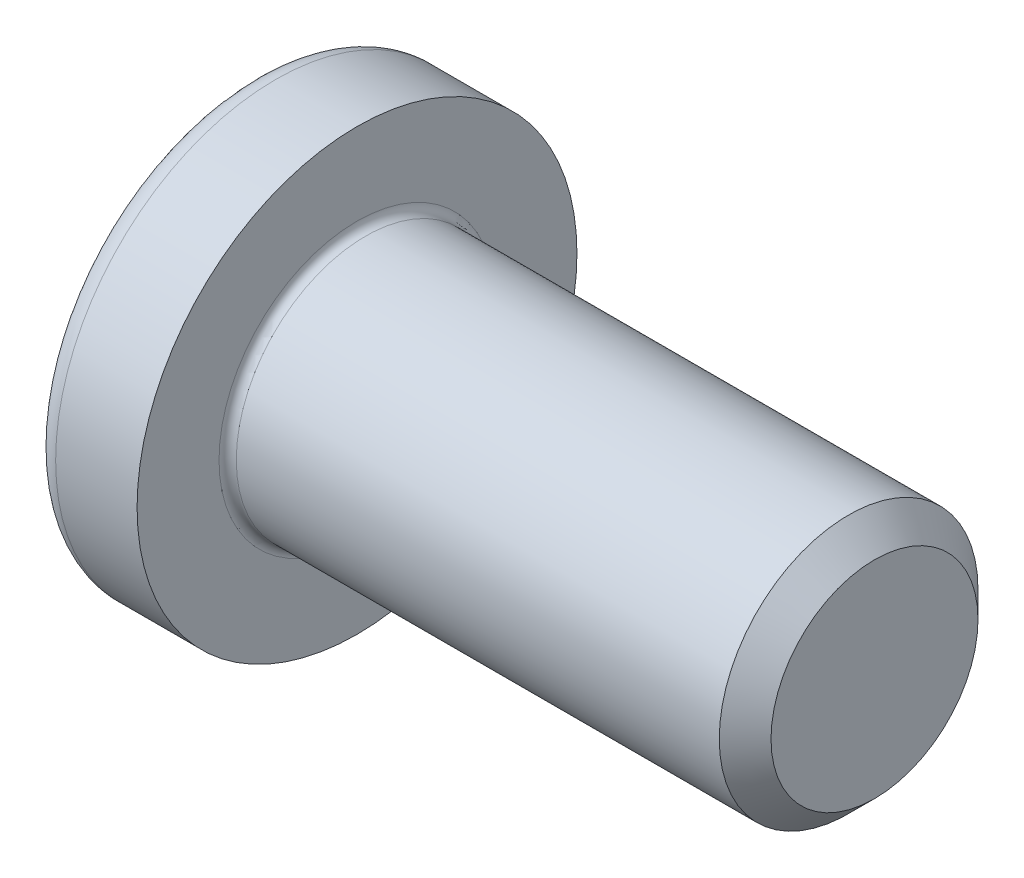
ISO-10303-21;
HEADER;
FILE_DESCRIPTION(('STEP AP214'),'2;1');
FILE_NAME('part.step','',(''),(''),'','','');
FILE_SCHEMA(('AUTOMOTIVE_DESIGN { 1 0 10303 214 1 1 1 1 }'));
ENDSEC;
DATA;
#1=APPLICATION_CONTEXT('core data for automotive mechanical design processes');
#2=APPLICATION_PROTOCOL_DEFINITION('international standard','automotive_design',2000,#1);
#3=PRODUCT_CONTEXT('',#1,'mechanical');
#4=PRODUCT('Part','Part','',(#3));
#5=PRODUCT_RELATED_PRODUCT_CATEGORY('part','',(#4));
#6=PRODUCT_DEFINITION_FORMATION('','',#4);
#7=PRODUCT_DEFINITION_CONTEXT('part definition',#1,'design');
#8=PRODUCT_DEFINITION('design','',#6,#7);
#9=PRODUCT_DEFINITION_SHAPE('','',#8);
#10=(LENGTH_UNIT() NAMED_UNIT(*) SI_UNIT(.MILLI.,.METRE.));
#11=(NAMED_UNIT(*) PLANE_ANGLE_UNIT() SI_UNIT($,.RADIAN.));
#12=(NAMED_UNIT(*) SI_UNIT($,.STERADIAN.) SOLID_ANGLE_UNIT());
#13=UNCERTAINTY_MEASURE_WITH_UNIT(LENGTH_MEASURE(1.E-05),#10,'distance_accuracy_value','');
#14=(GEOMETRIC_REPRESENTATION_CONTEXT(3) GLOBAL_UNCERTAINTY_ASSIGNED_CONTEXT((#13)) GLOBAL_UNIT_ASSIGNED_CONTEXT((#10,
#11,#12)) REPRESENTATION_CONTEXT('',''));
#15=CARTESIAN_POINT('',(0.,0.,0.));
#16=DIRECTION('',(0.,0.,1.));
#17=DIRECTION('',(1.,0.,0.));
#18=AXIS2_PLACEMENT_3D('',#15,#16,#17);
#19=CARTESIAN_POINT('',(5.,0.,0.));
#20=DIRECTION('',(-1.,0.,0.));
#21=DIRECTION('',(0.,1.,0.));
#22=AXIS2_PLACEMENT_3D('',#19,#20,#21);
#23=SPHERICAL_SURFACE('',#22,5.);
#24=CARTESIAN_POINT('',(0.619225335758571,0.,0.));
#25=DIRECTION('',(-1.,0.,0.));
#26=DIRECTION('',(0.,0.,1.));
#27=AXIS2_PLACEMENT_3D('',#24,#25,#26);
#28=CIRCLE('',#27,2.41014799154334);
#29=CARTESIAN_POINT('',(0.619225335758571,0.,2.41014799154334));
#30=VERTEX_POINT('',#29);
#31=EDGE_CURVE('E350',#30,#30,#28,.T.);
#32=ORIENTED_EDGE('',*,*,#31,.T.);
#33=EDGE_LOOP('',(#32));
#34=FACE_BOUND('',#33,.T.);
#35=CARTESIAN_POINT('',(0.04579512008964,0.,0.));
#36=DIRECTION('',(1.,0.,0.));
#37=DIRECTION('',(0.,0.,-1.));
#38=AXIS2_PLACEMENT_3D('',#35,#36,#37);
#39=CIRCLE('',#38,0.675169614150692);
#40=CARTESIAN_POINT('',(0.0457951200896384,-0.449999999999998,-0.503342833337673));
#41=VERTEX_POINT('',#40);
#42=CARTESIAN_POINT('',(0.0457951201179364,-0.503342833335017,-0.45));
#43=VERTEX_POINT('',#42);
#44=EDGE_CURVE('E398',#41,#43,#39,.F.);
#45=ORIENTED_EDGE('',*,*,#44,.F.);
#46=CARTESIAN_POINT('',(5.,-0.45,0.));
#47=DIRECTION('',(0.,1.,0.));
#48=DIRECTION('',(0.,0.,1.));
#49=AXIS2_PLACEMENT_3D('',#46,#47,#48);
#50=CIRCLE('',#49,4.97970882682914);
#51=CARTESIAN_POINT('',(0.286729744391537,-0.449999999999994,-1.60704184687163));
#52=VERTEX_POINT('',#51);
#53=EDGE_CURVE('E416',#52,#41,#50,.T.);
#54=ORIENTED_EDGE('',*,*,#53,.F.);
#55=CARTESIAN_POINT('',(4.70334382550035,0.,0.595000335588224));
#56=DIRECTION('',(0.446197753347436,0.,-0.894934391398443));
#57=DIRECTION('',(-0.894934391398442,0.,-0.446197753347436));
#58=AXIS2_PLACEMENT_3D('',#55,#56,#57);
#59=CIRCLE('',#58,4.95559983400407);
#60=CARTESIAN_POINT('',(0.286729744391538,0.450000000000006,-1.60704184687162));
#61=VERTEX_POINT('',#60);
#62=EDGE_CURVE('E237',#52,#61,#59,.T.);
#63=ORIENTED_EDGE('',*,*,#62,.T.);
#64=CARTESIAN_POINT('',(5.,0.45,0.));
#65=DIRECTION('',(0.,-1.,0.));
#66=DIRECTION('',(0.,0.,-1.));
#67=AXIS2_PLACEMENT_3D('',#64,#65,#66);
#68=CIRCLE('',#67,4.97970882682914);
#69=CARTESIAN_POINT('',(0.0457951200896617,0.450000000000002,-0.503342833337888));
#70=VERTEX_POINT('',#69);
#71=EDGE_CURVE('E339',#70,#61,#68,.T.);
#72=ORIENTED_EDGE('',*,*,#71,.F.);
#73=CARTESIAN_POINT('',(0.0457951200896401,0.503342833337671,-0.45));
#74=VERTEX_POINT('',#73);
#75=EDGE_CURVE('E396',#74,#70,#39,.F.);
#76=ORIENTED_EDGE('',*,*,#75,.F.);
#77=CARTESIAN_POINT('',(5.,0.,-0.45));
#78=DIRECTION('',(0.,0.,1.));
#79=DIRECTION('',(0.,-1.,0.));
#80=AXIS2_PLACEMENT_3D('',#77,#78,#79);
#81=CIRCLE('',#80,4.97970882682914);
#82=CARTESIAN_POINT('',(0.28672974439154,1.60704184687162,-0.45));
#83=VERTEX_POINT('',#82);
#84=EDGE_CURVE('E231',#83,#74,#81,.T.);
#85=ORIENTED_EDGE('',*,*,#84,.F.);
#86=CARTESIAN_POINT('',(4.70334382550035,-0.595000335588225,0.));
#87=DIRECTION('',(0.446197753347436,0.894934391398443,0.));
#88=DIRECTION('',(-0.894934391398442,0.446197753347436,0.));
#89=AXIS2_PLACEMENT_3D('',#86,#87,#88);
#90=CIRCLE('',#89,4.95559983400407);
#91=CARTESIAN_POINT('',(0.286729744391541,1.60704184687162,0.45));
#92=VERTEX_POINT('',#91);
#93=EDGE_CURVE('E234',#83,#92,#90,.T.);
#94=ORIENTED_EDGE('',*,*,#93,.T.);
#95=CARTESIAN_POINT('',(5.,0.,0.45));
#96=DIRECTION('',(0.,0.,-1.));
#97=DIRECTION('',(0.,1.,0.));
#98=AXIS2_PLACEMENT_3D('',#95,#96,#97);
#99=CIRCLE('',#98,4.97970882682914);
#100=CARTESIAN_POINT('',(0.045795120117937,0.503342833335017,0.45));
#101=VERTEX_POINT('',#100);
#102=EDGE_CURVE('E226',#101,#92,#99,.T.);
#103=ORIENTED_EDGE('',*,*,#102,.F.);
#104=CARTESIAN_POINT('',(0.0457951200896394,0.449999999999998,0.503342833337673));
#105=VERTEX_POINT('',#104);
#106=EDGE_CURVE('E399',#105,#101,#39,.F.);
#107=ORIENTED_EDGE('',*,*,#106,.F.);
#108=CARTESIAN_POINT('',(0.286729744391538,0.449999999999994,1.60704184687163));
#109=VERTEX_POINT('',#108);
#110=EDGE_CURVE('E340',#109,#105,#68,.T.);
#111=ORIENTED_EDGE('',*,*,#110,.F.);
#112=CARTESIAN_POINT('',(4.70334382550035,0.,-0.595000335588224));
#113=DIRECTION('',(0.446197753347436,0.,0.894934391398443));
#114=DIRECTION('',(0.894934391398442,0.,-0.446197753347436));
#115=AXIS2_PLACEMENT_3D('',#112,#113,#114);
#116=CIRCLE('',#115,4.95559983400407);
#117=CARTESIAN_POINT('',(0.286729744391537,-0.450000000000006,1.60704184687162));
#118=VERTEX_POINT('',#117);
#119=EDGE_CURVE('E240',#109,#118,#116,.T.);
#120=ORIENTED_EDGE('',*,*,#119,.T.);
#121=CARTESIAN_POINT('',(0.0457951200896617,-0.450000000000002,0.503342833337888));
#122=VERTEX_POINT('',#121);
#123=EDGE_CURVE('E408',#122,#118,#50,.T.);
#124=ORIENTED_EDGE('',*,*,#123,.F.);
#125=CARTESIAN_POINT('',(0.0457951201179362,-0.503342833335017,0.45));
#126=VERTEX_POINT('',#125);
#127=EDGE_CURVE('E59',#126,#122,#39,.F.);
#128=ORIENTED_EDGE('',*,*,#127,.F.);
#129=CARTESIAN_POINT('',(0.286729744391537,-1.60704184687162,0.45));
#130=VERTEX_POINT('',#129);
#131=EDGE_CURVE('E227',#130,#126,#99,.T.);
#132=ORIENTED_EDGE('',*,*,#131,.F.);
#133=CARTESIAN_POINT('',(4.70334382550035,0.595000335588223,0.));
#134=DIRECTION('',(0.446197753347436,-0.894934391398443,0.));
#135=DIRECTION('',(0.894934391398442,0.446197753347436,0.));
#136=AXIS2_PLACEMENT_3D('',#133,#134,#135);
#137=CIRCLE('',#136,4.95559983400407);
#138=CARTESIAN_POINT('',(0.286729744391537,-1.60704184687162,-0.45));
#139=VERTEX_POINT('',#138);
#140=EDGE_CURVE('E217',#130,#139,#137,.T.);
#141=ORIENTED_EDGE('',*,*,#140,.T.);
#142=EDGE_CURVE('E230',#43,#139,#81,.T.);
#143=ORIENTED_EDGE('',*,*,#142,.F.);
#144=EDGE_LOOP('',(#45,#54,#63,#72,#76,#85,#94,#103,#107,#111,#120,#124,#128,#132,#141,#143));
#145=FACE_BOUND('',#144,.T.);
#146=ADVANCED_FACE('F36',(#34,#145),#23,.T.);
#147=CARTESIAN_POINT('',(1.75,0.877482331818931,-0.45));
#148=DIRECTION('',(0.,0.,1.));
#149=DIRECTION('',(0.,-1.,0.));
#150=AXIS2_PLACEMENT_3D('',#147,#148,#149);
#151=PLANE('',#150);
#152=ORIENTED_EDGE('',*,*,#84,.T.);
#153=CARTESIAN_POINT('',(-0.983674468531429,0.596442614644447,-0.45));
#154=CARTESIAN_POINT('',(-0.778484784487605,0.578450280714038,-0.45));
#155=CARTESIAN_POINT('',(-0.573316860965826,0.560200188981624,-0.45));
#156=CARTESIAN_POINT('',(-0.163017653016979,0.522907016012318,-0.45));
#157=CARTESIAN_POINT('',(0.04211361901709,0.503863798764271,-0.45));
#158=CARTESIAN_POINT('',(0.452274395451018,0.464713034802642,-0.45));
#159=CARTESIAN_POINT('',(0.657303900499246,0.444605494960174,-0.45));
#160=CARTESIAN_POINT('',(0.964713459529383,0.413244938032553,-0.45));
#161=CARTESIAN_POINT('',(1.06715466980727,0.402592225216101,-0.45));
#162=CARTESIAN_POINT('',(1.27198494870204,0.38077691937699,-0.45));
#163=CARTESIAN_POINT('',(1.37437401629635,0.369614316716927,-0.45));
#164=CARTESIAN_POINT('',(1.57910422094271,0.346624507563432,-0.45));
#165=CARTESIAN_POINT('',(1.68144533932816,0.334797133729848,-0.45));
#166=CARTESIAN_POINT('',(1.88601467610888,0.310241669630587,-0.45));
#167=CARTESIAN_POINT('',(1.98824290002327,0.297513625573465,-0.45));
#168=CARTESIAN_POINT('',(2.19256272994349,0.270758651376356,-0.45));
#169=CARTESIAN_POINT('',(2.29465428793973,0.256731346995199,-0.45));
#170=CARTESIAN_POINT('',(2.44757216733847,0.234130917746685,-0.45));
#171=CARTESIAN_POINT('',(2.49851255983247,0.226336796758432,-0.45));
#172=CARTESIAN_POINT('',(2.60027916061769,0.210015382535512,-0.45));
#173=CARTESIAN_POINT('',(2.651105360022,0.201488034137144,-0.45));
#174=CARTESIAN_POINT('',(2.70185157125896,0.192487835069277,-0.45));
#175=B_SPLINE_CURVE_WITH_KNOTS('',3,(#153,#154,#155,#156,#157,#158,#159,#160,#161,#162,#163,
#164,#165,#166,#167,#168,#169,#170,#171,#172,#173,#174),.UNSPECIFIED.,.F.,.F.,(4,2,2,2,2,2,2,2,
2,2,4),(0.,0.617932045833623,1.23597049919537,1.85400496307627,2.16298481460555,
2.47197050856609,2.78103433365428,3.09008231381717,3.39921959117497,3.55381464520816,
3.70842134025387),.UNSPECIFIED.);
#176=CARTESIAN_POINT('',(0.600282161685729,0.450000000000002,-0.449999999999999));
#177=VERTEX_POINT('',#176);
#178=EDGE_CURVE('E279',#74,#177,#175,.T.);
#179=ORIENTED_EDGE('',*,*,#178,.T.);
#180=DIRECTION('',(1.,0.,0.));
#181=VECTOR('',#180,1.);
#182=CARTESIAN_POINT('',(1.75,0.450000000000002,-0.45));
#183=LINE('',#182,#181);
#184=CARTESIAN_POINT('',(1.75,0.450000000000002,-0.45));
#185=VERTEX_POINT('',#184);
#186=EDGE_CURVE('E333',#177,#185,#183,.T.);
#187=ORIENTED_EDGE('',*,*,#186,.T.);
#188=DIRECTION('',(0.,1.,0.));
#189=VECTOR('',#188,1.);
#190=CARTESIAN_POINT('',(1.75,-0.877482331818931,-0.45));
#191=LINE('',#190,#189);
#192=CARTESIAN_POINT('',(1.75,0.877482331818931,-0.45));
#193=VERTEX_POINT('',#192);
#194=EDGE_CURVE('E342',#185,#193,#191,.T.);
#195=ORIENTED_EDGE('',*,*,#194,.T.);
#196=DIRECTION('',(0.894934391398442,-0.446197753347436,0.));
#197=VECTOR('',#196,1.);
#198=CARTESIAN_POINT('',(0.,1.75,-0.45));
#199=LINE('',#198,#197);
#200=EDGE_CURVE('E347',#83,#193,#199,.T.);
#201=ORIENTED_EDGE('',*,*,#200,.F.);
#202=EDGE_LOOP('',(#152,#179,#187,#195,#201));
#203=FACE_BOUND('',#202,.T.);
#204=ADVANCED_FACE('F165',(#203),#151,.T.);
#205=DIRECTION('',(-1.,0.,0.));
#206=VECTOR('',#205,1.);
#207=CARTESIAN_POINT('',(1.75,-0.449999999999998,-0.45));
#208=LINE('',#207,#206);
#209=CARTESIAN_POINT('',(1.75,-0.449999999999998,-0.45));
#210=VERTEX_POINT('',#209);
#211=CARTESIAN_POINT('',(0.600282161685762,-0.449999999999998,-0.45));
#212=VERTEX_POINT('',#211);
#213=EDGE_CURVE('E414',#210,#212,#208,.T.);
#214=ORIENTED_EDGE('',*,*,#213,.T.);
#215=CARTESIAN_POINT('',(-0.983674467524667,-0.596442614556258,-0.45));
#216=CARTESIAN_POINT('',(-0.778484783537036,-0.5784502806298,-0.45));
#217=CARTESIAN_POINT('',(-0.573316860071447,-0.560200188901377,-0.45));
#218=CARTESIAN_POINT('',(-0.163017652235162,-0.52290701594017,-0.45));
#219=CARTESIAN_POINT('',(0.0421136197425343,-0.503863798696232,-0.45));
#220=CARTESIAN_POINT('',(0.452274395813954,-0.464713034766789,-0.45));
#221=CARTESIAN_POINT('',(0.657303900556169,-0.444605494953692,-0.45));
#222=CARTESIAN_POINT('',(0.964713459127772,-0.413244938073858,-0.45));
#223=CARTESIAN_POINT('',(1.06715466925295,-0.402592225273951,-0.45));
#224=CARTESIAN_POINT('',(1.27198494784246,-0.380776919469732,-0.45));
#225=CARTESIAN_POINT('',(1.37437401528423,-0.369614316828016,-0.45));
#226=CARTESIAN_POINT('',(1.57910421968958,-0.346624507706723,-0.45));
#227=CARTESIAN_POINT('',(1.6814453379865,-0.334797133886581,-0.45));
#228=CARTESIAN_POINT('',(1.88601467459062,-0.31024166981715,-0.45));
#229=CARTESIAN_POINT('',(1.98824289841693,-0.297513625776414,-0.45));
#230=CARTESIAN_POINT('',(2.19256272816149,-0.270758651617196,-0.45));
#231=CARTESIAN_POINT('',(2.29465428607016,-0.256731347257549,-0.45));
#232=CARTESIAN_POINT('',(2.4475721653388,-0.234130918049218,-0.45));
#233=CARTESIAN_POINT('',(2.49851255778961,-0.226336797075687,-0.45));
#234=CARTESIAN_POINT('',(2.60027915848928,-0.210015382886851,-0.45));
#235=CARTESIAN_POINT('',(2.65110535785124,-0.201488034507846,-0.45));
#236=CARTESIAN_POINT('',(2.70185156904652,-0.192487835462656,-0.45));
#237=B_SPLINE_CURVE_WITH_KNOTS('',3,(#215,#216,#217,#218,#219,#220,#221,#222,#223,#224,#225,
#226,#227,#228,#229,#230,#231,#232,#233,#234,#235,#236),.UNSPECIFIED.,.F.,.F.,(4,2,2,2,2,2,2,2,
2,2,4),(0.,0.617932045664654,1.23597049885687,1.85400496181553,2.162984812884,2.47197050638366,
2.78103433120342,3.09008231109805,3.3992195881869,3.55381464208536,3.7084213369962),.UNSPECIFIED.);
#238=EDGE_CURVE('E263',#212,#43,#237,.F.);
#239=ORIENTED_EDGE('',*,*,#238,.T.);
#240=ORIENTED_EDGE('',*,*,#142,.T.);
#241=DIRECTION('',(0.894934391398442,0.446197753347436,0.));
#242=VECTOR('',#241,1.);
#243=CARTESIAN_POINT('',(0.,-1.75,-0.45));
#244=LINE('',#243,#242);
#245=CARTESIAN_POINT('',(1.75,-0.877482331818931,-0.45));
#246=VERTEX_POINT('',#245);
#247=EDGE_CURVE('E353',#139,#246,#244,.T.);
#248=ORIENTED_EDGE('',*,*,#247,.T.);
#249=EDGE_CURVE('E368',#246,#210,#191,.T.);
#250=ORIENTED_EDGE('',*,*,#249,.T.);
#251=EDGE_LOOP('',(#214,#239,#240,#248,#250));
#252=FACE_BOUND('',#251,.T.);
#253=ADVANCED_FACE('F171',(#252),#151,.T.);
#254=CARTESIAN_POINT('',(1.75,-0.877482331818931,0.45));
#255=DIRECTION('',(0.,0.,-1.));
#256=DIRECTION('',(0.,1.,0.));
#257=AXIS2_PLACEMENT_3D('',#254,#255,#256);
#258=PLANE('',#257);
#259=DIRECTION('',(-1.,0.,0.));
#260=VECTOR('',#259,1.);
#261=CARTESIAN_POINT('',(1.75,0.449999999999998,0.45));
#262=LINE('',#261,#260);
#263=CARTESIAN_POINT('',(1.75,0.449999999999998,0.45));
#264=VERTEX_POINT('',#263);
#265=CARTESIAN_POINT('',(0.600282161685761,0.449999999999998,0.45));
#266=VERTEX_POINT('',#265);
#267=EDGE_CURVE('E344',#264,#266,#262,.T.);
#268=ORIENTED_EDGE('',*,*,#267,.T.);
#269=CARTESIAN_POINT('',(-0.983674467524666,0.596442614556258,0.45));
#270=CARTESIAN_POINT('',(-0.778484783537036,0.5784502806298,0.45));
#271=CARTESIAN_POINT('',(-0.573316860071447,0.560200188901377,0.45));
#272=CARTESIAN_POINT('',(-0.163017652235162,0.52290701594017,0.45));
#273=CARTESIAN_POINT('',(0.042113619742535,0.503863798696232,0.45));
#274=CARTESIAN_POINT('',(0.452274395813955,0.464713034766789,0.45));
#275=CARTESIAN_POINT('',(0.65730390055617,0.444605494953692,0.45));
#276=CARTESIAN_POINT('',(0.964713459127772,0.413244938073858,0.45));
#277=CARTESIAN_POINT('',(1.06715466925295,0.402592225273951,0.45));
#278=CARTESIAN_POINT('',(1.27198494784246,0.380776919469732,0.45));
#279=CARTESIAN_POINT('',(1.37437401528423,0.369614316828016,0.45));
#280=CARTESIAN_POINT('',(1.57910421968958,0.346624507706723,0.45));
#281=CARTESIAN_POINT('',(1.6814453379865,0.334797133886581,0.45));
#282=CARTESIAN_POINT('',(1.88601467459062,0.31024166981715,0.45));
#283=CARTESIAN_POINT('',(1.98824289841693,0.297513625776414,0.45));
#284=CARTESIAN_POINT('',(2.19256272816149,0.270758651617196,0.45));
#285=CARTESIAN_POINT('',(2.29465428607016,0.256731347257549,0.45));
#286=CARTESIAN_POINT('',(2.4475721653388,0.234130918049218,0.45));
#287=CARTESIAN_POINT('',(2.49851255778961,0.226336797075688,0.45));
#288=CARTESIAN_POINT('',(2.60027915848928,0.210015382886852,0.45));
#289=CARTESIAN_POINT('',(2.65110535785124,0.201488034507846,0.45));
#290=CARTESIAN_POINT('',(2.70185156904652,0.192487835462656,0.45));
#291=B_SPLINE_CURVE_WITH_KNOTS('',3,(#269,#270,#271,#272,#273,#274,#275,#276,#277,#278,#279,
#280,#281,#282,#283,#284,#285,#286,#287,#288,#289,#290),.UNSPECIFIED.,.F.,.F.,(4,2,2,2,2,2,2,2,
2,2,4),(0.,0.617932045664654,1.23597049885687,1.85400496181553,2.162984812884,2.47197050638366,
2.78103433120342,3.09008231109805,3.3992195881869,3.55381464208536,3.7084213369962),.UNSPECIFIED.);
#292=EDGE_CURVE('E51',#266,#101,#291,.F.);
#293=ORIENTED_EDGE('',*,*,#292,.T.);
#294=ORIENTED_EDGE('',*,*,#102,.T.);
#295=DIRECTION('',(0.894934391398442,-0.446197753347436,0.));
#296=VECTOR('',#295,1.);
#297=CARTESIAN_POINT('',(0.,1.75,0.45));
#298=LINE('',#297,#296);
#299=CARTESIAN_POINT('',(1.75,0.877482331818931,0.45));
#300=VERTEX_POINT('',#299);
#301=EDGE_CURVE('E351',#92,#300,#298,.T.);
#302=ORIENTED_EDGE('',*,*,#301,.T.);
#303=DIRECTION('',(0.,-1.,0.));
#304=VECTOR('',#303,1.);
#305=CARTESIAN_POINT('',(1.75,0.877482331818931,0.45));
#306=LINE('',#305,#304);
#307=EDGE_CURVE('E361',#300,#264,#306,.T.);
#308=ORIENTED_EDGE('',*,*,#307,.T.);
#309=EDGE_LOOP('',(#268,#293,#294,#302,#308));
#310=FACE_BOUND('',#309,.T.);
#311=ADVANCED_FACE('F391',(#310),#258,.T.);
#312=ORIENTED_EDGE('',*,*,#131,.T.);
#313=CARTESIAN_POINT('',(-0.983674467524667,-0.596442614556259,0.45));
#314=CARTESIAN_POINT('',(-0.778484783537036,-0.5784502806298,0.45));
#315=CARTESIAN_POINT('',(-0.573316860071448,-0.560200188901377,0.45));
#316=CARTESIAN_POINT('',(-0.163017652235163,-0.52290701594017,0.45));
#317=CARTESIAN_POINT('',(0.0421136197425342,-0.503863798696233,0.45));
#318=CARTESIAN_POINT('',(0.452274395813954,-0.464713034766789,0.45));
#319=CARTESIAN_POINT('',(0.65730390055617,-0.444605494953693,0.45));
#320=CARTESIAN_POINT('',(0.964713459127772,-0.413244938073858,0.45));
#321=CARTESIAN_POINT('',(1.06715466925295,-0.402592225273951,0.45));
#322=CARTESIAN_POINT('',(1.27198494784246,-0.380776919469732,0.45));
#323=CARTESIAN_POINT('',(1.37437401528423,-0.369614316828016,0.45));
#324=CARTESIAN_POINT('',(1.57910421968958,-0.346624507706723,0.45));
#325=CARTESIAN_POINT('',(1.6814453379865,-0.334797133886581,0.45));
#326=CARTESIAN_POINT('',(1.88601467459062,-0.310241669817151,0.45));
#327=CARTESIAN_POINT('',(1.98824289841693,-0.297513625776414,0.45));
#328=CARTESIAN_POINT('',(2.19256272816149,-0.270758651617196,0.45));
#329=CARTESIAN_POINT('',(2.29465428607015,-0.256731347257549,0.45));
#330=CARTESIAN_POINT('',(2.4475721653388,-0.234130918049218,0.45));
#331=CARTESIAN_POINT('',(2.49851255778961,-0.226336797075688,0.45));
#332=CARTESIAN_POINT('',(2.60027915848928,-0.210015382886852,0.45));
#333=CARTESIAN_POINT('',(2.65110535785124,-0.201488034507847,0.45));
#334=CARTESIAN_POINT('',(2.70185156904652,-0.192487835462656,0.45));
#335=B_SPLINE_CURVE_WITH_KNOTS('',3,(#313,#314,#315,#316,#317,#318,#319,#320,#321,#322,#323,
#324,#325,#326,#327,#328,#329,#330,#331,#332,#333,#334),.UNSPECIFIED.,.F.,.F.,(4,2,2,2,2,2,2,2,
2,2,4),(0.,0.617932045664654,1.23597049885687,1.85400496181553,2.162984812884,2.47197050638366,
2.78103433120342,3.09008231109805,3.3992195881869,3.55381464208536,3.7084213369962),.UNSPECIFIED.);
#336=CARTESIAN_POINT('',(0.600282161685731,-0.450000000000001,0.449999999999999));
#337=VERTEX_POINT('',#336);
#338=EDGE_CURVE('E292',#126,#337,#335,.T.);
#339=ORIENTED_EDGE('',*,*,#338,.T.);
#340=DIRECTION('',(1.,0.,0.));
#341=VECTOR('',#340,1.);
#342=CARTESIAN_POINT('',(1.75,-0.450000000000002,0.45));
#343=LINE('',#342,#341);
#344=CARTESIAN_POINT('',(1.75,-0.45,0.45));
#345=VERTEX_POINT('',#344);
#346=EDGE_CURVE('E411',#337,#345,#343,.T.);
#347=ORIENTED_EDGE('',*,*,#346,.T.);
#348=CARTESIAN_POINT('',(1.75,-0.877482331818931,0.45));
#349=VERTEX_POINT('',#348);
#350=EDGE_CURVE('E364',#345,#349,#306,.T.);
#351=ORIENTED_EDGE('',*,*,#350,.T.);
#352=DIRECTION('',(0.894934391398442,0.446197753347436,0.));
#353=VECTOR('',#352,1.);
#354=CARTESIAN_POINT('',(0.,-1.75,0.45));
#355=LINE('',#354,#353);
#356=EDGE_CURVE('E355',#130,#349,#355,.T.);
#357=ORIENTED_EDGE('',*,*,#356,.F.);
#358=EDGE_LOOP('',(#312,#339,#347,#351,#357));
#359=FACE_BOUND('',#358,.T.);
#360=ADVANCED_FACE('F321',(#359),#258,.T.);
#361=CARTESIAN_POINT('',(1.75,0.877482331818931,-0.45));
#362=DIRECTION('',(-1.,0.,0.));
#363=DIRECTION('',(0.,0.,1.));
#364=AXIS2_PLACEMENT_3D('',#361,#362,#363);
#365=PLANE('',#364);
#366=ORIENTED_EDGE('',*,*,#350,.F.);
#367=DIRECTION('',(0.,0.,-1.));
#368=VECTOR('',#367,1.);
#369=CARTESIAN_POINT('',(1.75,-0.450000000000003,0.87748233181893));
#370=LINE('',#369,#368);
#371=CARTESIAN_POINT('',(1.75,-0.450000000000003,0.87748233181893));
#372=VERTEX_POINT('',#371);
#373=EDGE_CURVE('E435',#372,#345,#370,.T.);
#374=ORIENTED_EDGE('',*,*,#373,.F.);
#375=DIRECTION('',(0.,1.,0.));
#376=VECTOR('',#375,1.);
#377=CARTESIAN_POINT('',(1.75,-0.450000000000003,0.87748233181893));
#378=LINE('',#377,#376);
#379=CARTESIAN_POINT('',(1.75,0.449999999999997,0.877482331818933));
#380=VERTEX_POINT('',#379);
#381=EDGE_CURVE('E436',#372,#380,#378,.T.);
#382=ORIENTED_EDGE('',*,*,#381,.T.);
#383=DIRECTION('',(0.,0.,1.));
#384=VECTOR('',#383,1.);
#385=CARTESIAN_POINT('',(1.75,0.450000000000003,-0.87748233181893));
#386=LINE('',#385,#384);
#387=EDGE_CURVE('E388',#264,#380,#386,.T.);
#388=ORIENTED_EDGE('',*,*,#387,.F.);
#389=ORIENTED_EDGE('',*,*,#307,.F.);
#390=DIRECTION('',(0.,0.,-1.));
#391=VECTOR('',#390,1.);
#392=CARTESIAN_POINT('',(1.75,0.877482331818931,0.45));
#393=LINE('',#392,#391);
#394=EDGE_CURVE('E365',#300,#193,#393,.T.);
#395=ORIENTED_EDGE('',*,*,#394,.T.);
#396=ORIENTED_EDGE('',*,*,#194,.F.);
#397=CARTESIAN_POINT('',(1.75,0.450000000000003,-0.87748233181893));
#398=VERTEX_POINT('',#397);
#399=EDGE_CURVE('E336',#398,#185,#386,.T.);
#400=ORIENTED_EDGE('',*,*,#399,.F.);
#401=DIRECTION('',(0.,-1.,0.));
#402=VECTOR('',#401,1.);
#403=CARTESIAN_POINT('',(1.75,0.450000000000003,-0.87748233181893));
#404=LINE('',#403,#402);
#405=CARTESIAN_POINT('',(1.75,-0.449999999999997,-0.877482331818933));
#406=VERTEX_POINT('',#405);
#407=EDGE_CURVE('E434',#398,#406,#404,.T.);
#408=ORIENTED_EDGE('',*,*,#407,.T.);
#409=EDGE_CURVE('E432',#210,#406,#370,.T.);
#410=ORIENTED_EDGE('',*,*,#409,.F.);
#411=ORIENTED_EDGE('',*,*,#249,.F.);
#412=DIRECTION('',(0.,0.,1.));
#413=VECTOR('',#412,1.);
#414=CARTESIAN_POINT('',(1.75,-0.877482331818931,-0.45));
#415=LINE('',#414,#413);
#416=EDGE_CURVE('E358',#246,#349,#415,.T.);
#417=ORIENTED_EDGE('',*,*,#416,.T.);
#418=EDGE_LOOP('',(#366,#374,#382,#388,#389,#395,#396,#400,#408,#410,#411,#417));
#419=FACE_BOUND('',#418,.T.);
#420=CARTESIAN_POINT('',(1.75,0.,0.));
#421=DIRECTION('',(-1.,0.,0.));
#422=DIRECTION('',(0.,0.,1.));
#423=AXIS2_PLACEMENT_3D('',#420,#421,#422);
#424=CIRCLE('',#423,0.556);
#425=CARTESIAN_POINT('',(1.75,0.,0.556));
#426=VERTEX_POINT('',#425);
#427=EDGE_CURVE('E402',#426,#426,#424,.T.);
#428=ORIENTED_EDGE('',*,*,#427,.F.);
#429=EDGE_LOOP('',(#428));
#430=FACE_BOUND('',#429,.T.);
#431=ADVANCED_FACE('F312',(#419,#430),#365,.T.);
#432=CARTESIAN_POINT('',(1.75,0.449999999999997,0.877482331818933));
#433=DIRECTION('',(0.,-1.,0.));
#434=DIRECTION('',(0.,0.,-1.));
#435=AXIS2_PLACEMENT_3D('',#432,#433,#434);
#436=PLANE('',#435);
#437=ORIENTED_EDGE('',*,*,#110,.T.);
#438=CARTESIAN_POINT('',(-0.983674468531429,0.449999999999998,0.596442614644449));
#439=CARTESIAN_POINT('',(-0.778484784487605,0.449999999999998,0.57845028071404));
#440=CARTESIAN_POINT('',(-0.573316860965825,0.449999999999998,0.560200188981626));
#441=CARTESIAN_POINT('',(-0.163017653016978,0.449999999999998,0.522907016012319));
#442=CARTESIAN_POINT('',(0.0421136190170905,0.449999999999998,0.503863798764272));
#443=CARTESIAN_POINT('',(0.452274395451018,0.449999999999998,0.464713034802644));
#444=CARTESIAN_POINT('',(0.657303900499245,0.449999999999998,0.444605494960176));
#445=CARTESIAN_POINT('',(0.964713459529383,0.449999999999999,0.413244938032554));
#446=CARTESIAN_POINT('',(1.06715466980727,0.449999999999999,0.402592225216103));
#447=CARTESIAN_POINT('',(1.27198494870204,0.449999999999999,0.380776919376991));
#448=CARTESIAN_POINT('',(1.37437401629635,0.449999999999999,0.369614316716929));
#449=CARTESIAN_POINT('',(1.57910422094271,0.449999999999999,0.346624507563434));
#450=CARTESIAN_POINT('',(1.68144533932816,0.449999999999999,0.334797133729849));
#451=CARTESIAN_POINT('',(1.88601467610888,0.449999999999999,0.310241669630589));
#452=CARTESIAN_POINT('',(1.98824290002327,0.449999999999999,0.297513625573467));
#453=CARTESIAN_POINT('',(2.19256272994349,0.449999999999999,0.270758651376357));
#454=CARTESIAN_POINT('',(2.29465428793973,0.449999999999999,0.256731346995201));
#455=CARTESIAN_POINT('',(2.44757216733847,0.449999999999999,0.234130917746686));
#456=CARTESIAN_POINT('',(2.49851255983247,0.449999999999999,0.226336796758433));
#457=CARTESIAN_POINT('',(2.60027916061769,0.449999999999999,0.210015382535513));
#458=CARTESIAN_POINT('',(2.651105360022,0.449999999999999,0.201488034137145));
#459=CARTESIAN_POINT('',(2.70185157125896,0.449999999999999,0.192487835069278));
#460=B_SPLINE_CURVE_WITH_KNOTS('',3,(#438,#439,#440,#441,#442,#443,#444,#445,#446,#447,#448,
#449,#450,#451,#452,#453,#454,#455,#456,#457,#458,#459),.UNSPECIFIED.,.F.,.F.,(4,2,2,2,2,2,2,2,
2,2,4),(0.,0.617932045833624,1.23597049919537,1.85400496307627,2.16298481460555,
2.47197050856609,2.78103433365428,3.09008231381717,3.39921959117497,3.55381464520816,
3.70842134025387),.UNSPECIFIED.);
#461=EDGE_CURVE('E299',#105,#266,#460,.T.);
#462=ORIENTED_EDGE('',*,*,#461,.T.);
#463=ORIENTED_EDGE('',*,*,#267,.F.);
#464=ORIENTED_EDGE('',*,*,#387,.T.);
#465=DIRECTION('',(0.894934391398442,0.,-0.446197753347436));
#466=VECTOR('',#465,1.);
#467=CARTESIAN_POINT('',(0.,0.449999999999994,1.75));
#468=LINE('',#467,#466);
#469=EDGE_CURVE('E418',#109,#380,#468,.T.);
#470=ORIENTED_EDGE('',*,*,#469,.F.);
#471=EDGE_LOOP('',(#437,#462,#463,#464,#470));
#472=FACE_BOUND('',#471,.T.);
#473=ADVANCED_FACE('F309',(#472),#436,.T.);
#474=CARTESIAN_POINT('',(1.75,-0.449999999999997,-0.877482331818932));
#475=DIRECTION('',(0.,1.,0.));
#476=DIRECTION('',(0.,0.,1.));
#477=AXIS2_PLACEMENT_3D('',#474,#475,#476);
#478=PLANE('',#477);
#479=ORIENTED_EDGE('',*,*,#346,.F.);
#480=CARTESIAN_POINT('',(-0.983674467524667,-0.450000000000002,0.596442614556257));
#481=CARTESIAN_POINT('',(-0.778484783537037,-0.450000000000002,0.578450280629798));
#482=CARTESIAN_POINT('',(-0.573316860071448,-0.450000000000002,0.560200188901375));
#483=CARTESIAN_POINT('',(-0.163017652235163,-0.450000000000002,0.522907015940168));
#484=CARTESIAN_POINT('',(0.0421136197425342,-0.450000000000002,0.503863798696231));
#485=CARTESIAN_POINT('',(0.452274395813954,-0.450000000000001,0.464713034766787));
#486=CARTESIAN_POINT('',(0.65730390055617,-0.450000000000001,0.444605494953691));
#487=CARTESIAN_POINT('',(0.964713459127772,-0.450000000000001,0.413244938073856));
#488=CARTESIAN_POINT('',(1.06715466925295,-0.450000000000001,0.40259222527395));
#489=CARTESIAN_POINT('',(1.27198494784246,-0.450000000000001,0.38077691946973));
#490=CARTESIAN_POINT('',(1.37437401528423,-0.450000000000001,0.369614316828014));
#491=CARTESIAN_POINT('',(1.57910421968958,-0.450000000000001,0.346624507706721));
#492=CARTESIAN_POINT('',(1.6814453379865,-0.450000000000001,0.33479713388658));
#493=CARTESIAN_POINT('',(1.88601467459062,-0.450000000000001,0.310241669817149));
#494=CARTESIAN_POINT('',(1.98824289841693,-0.450000000000001,0.297513625776413));
#495=CARTESIAN_POINT('',(2.19256272816149,-0.450000000000001,0.270758651617195));
#496=CARTESIAN_POINT('',(2.29465428607015,-0.450000000000001,0.256731347257548));
#497=CARTESIAN_POINT('',(2.4475721653388,-0.450000000000001,0.234130918049216));
#498=CARTESIAN_POINT('',(2.49851255778961,-0.450000000000001,0.226336797075686));
#499=CARTESIAN_POINT('',(2.60027915848928,-0.450000000000001,0.21001538288685));
#500=CARTESIAN_POINT('',(2.65110535785124,-0.450000000000001,0.201488034507845));
#501=CARTESIAN_POINT('',(2.70185156904652,-0.450000000000001,0.192487835462654));
#502=B_SPLINE_CURVE_WITH_KNOTS('',3,(#480,#481,#482,#483,#484,#485,#486,#487,#488,#489,#490,
#491,#492,#493,#494,#495,#496,#497,#498,#499,#500,#501),.UNSPECIFIED.,.F.,.F.,(4,2,2,2,2,2,2,2,
2,2,4),(0.,0.617932045664654,1.23597049885687,1.85400496181553,2.162984812884,2.47197050638366,
2.78103433120342,3.09008231109805,3.3992195881869,3.55381464208536,3.7084213369962),.UNSPECIFIED.);
#503=EDGE_CURVE('E286',#337,#122,#502,.F.);
#504=ORIENTED_EDGE('',*,*,#503,.T.);
#505=ORIENTED_EDGE('',*,*,#123,.T.);
#506=DIRECTION('',(0.894934391398442,0.,-0.446197753347436));
#507=VECTOR('',#506,1.);
#508=CARTESIAN_POINT('',(0.,-0.450000000000006,1.75));
#509=LINE('',#508,#507);
#510=EDGE_CURVE('E444',#118,#372,#509,.T.);
#511=ORIENTED_EDGE('',*,*,#510,.T.);
#512=ORIENTED_EDGE('',*,*,#373,.T.);
#513=EDGE_LOOP('',(#479,#504,#505,#511,#512));
#514=FACE_BOUND('',#513,.T.);
#515=ADVANCED_FACE('F250',(#514),#478,.T.);
#516=ORIENTED_EDGE('',*,*,#186,.F.);
#517=CARTESIAN_POINT('',(-0.98367446853143,0.450000000000002,-0.596442614644446));
#518=CARTESIAN_POINT('',(-0.778484784487605,0.450000000000002,-0.578450280714036));
#519=CARTESIAN_POINT('',(-0.573316860965826,0.450000000000002,-0.560200188981622));
#520=CARTESIAN_POINT('',(-0.163017653016979,0.450000000000002,-0.522907016012316));
#521=CARTESIAN_POINT('',(0.0421136190170902,0.450000000000002,-0.503863798764269));
#522=CARTESIAN_POINT('',(0.452274395451017,0.450000000000002,-0.464713034802641));
#523=CARTESIAN_POINT('',(0.657303900499245,0.450000000000002,-0.444605494960173));
#524=CARTESIAN_POINT('',(0.964713459529382,0.450000000000001,-0.413244938032551));
#525=CARTESIAN_POINT('',(1.06715466980727,0.450000000000001,-0.4025922252161));
#526=CARTESIAN_POINT('',(1.27198494870204,0.450000000000001,-0.380776919376988));
#527=CARTESIAN_POINT('',(1.37437401629635,0.450000000000001,-0.369614316716926));
#528=CARTESIAN_POINT('',(1.57910422094271,0.450000000000001,-0.346624507563431));
#529=CARTESIAN_POINT('',(1.68144533932816,0.450000000000001,-0.334797133729846));
#530=CARTESIAN_POINT('',(1.88601467610888,0.450000000000001,-0.310241669630586));
#531=CARTESIAN_POINT('',(1.98824290002327,0.450000000000001,-0.297513625573464));
#532=CARTESIAN_POINT('',(2.19256272994349,0.450000000000001,-0.270758651376354));
#533=CARTESIAN_POINT('',(2.29465428793973,0.450000000000001,-0.256731346995198));
#534=CARTESIAN_POINT('',(2.44757216733847,0.450000000000001,-0.234130917746683));
#535=CARTESIAN_POINT('',(2.49851255983247,0.450000000000001,-0.22633679675843));
#536=CARTESIAN_POINT('',(2.60027916061769,0.450000000000001,-0.21001538253551));
#537=CARTESIAN_POINT('',(2.651105360022,0.450000000000001,-0.201488034137142));
#538=CARTESIAN_POINT('',(2.70185157125896,0.450000000000001,-0.192487835069275));
#539=B_SPLINE_CURVE_WITH_KNOTS('',3,(#517,#518,#519,#520,#521,#522,#523,#524,#525,#526,#527,
#528,#529,#530,#531,#532,#533,#534,#535,#536,#537,#538),.UNSPECIFIED.,.F.,.F.,(4,2,2,2,2,2,2,2,
2,2,4),(0.,0.617932045833624,1.23597049919537,1.85400496307627,2.16298481460555,
2.47197050856609,2.78103433365428,3.09008231381717,3.39921959117497,3.55381464520816,
3.70842134025387),.UNSPECIFIED.);
#540=EDGE_CURVE('E272',#177,#70,#539,.F.);
#541=ORIENTED_EDGE('',*,*,#540,.T.);
#542=ORIENTED_EDGE('',*,*,#71,.T.);
#543=DIRECTION('',(0.894934391398442,0.,0.446197753347436));
#544=VECTOR('',#543,1.);
#545=CARTESIAN_POINT('',(0.,0.450000000000006,-1.75));
#546=LINE('',#545,#544);
#547=EDGE_CURVE('E442',#61,#398,#546,.T.);
#548=ORIENTED_EDGE('',*,*,#547,.T.);
#549=ORIENTED_EDGE('',*,*,#399,.T.);
#550=EDGE_LOOP('',(#516,#541,#542,#548,#549));
#551=FACE_BOUND('',#550,.T.);
#552=ADVANCED_FACE('F314',(#551),#436,.T.);
#553=ORIENTED_EDGE('',*,*,#53,.T.);
#554=CARTESIAN_POINT('',(-0.983674467524667,-0.449999999999998,-0.59644261455626));
#555=CARTESIAN_POINT('',(-0.778484783537036,-0.449999999999998,-0.578450280629802));
#556=CARTESIAN_POINT('',(-0.573316860071447,-0.449999999999998,-0.560200188901379));
#557=CARTESIAN_POINT('',(-0.163017652235163,-0.449999999999998,-0.522907015940172));
#558=CARTESIAN_POINT('',(0.0421136197425345,-0.449999999999998,-0.503863798696234));
#559=CARTESIAN_POINT('',(0.452274395813955,-0.449999999999998,-0.464713034766791));
#560=CARTESIAN_POINT('',(0.65730390055617,-0.449999999999998,-0.444605494953694));
#561=CARTESIAN_POINT('',(0.964713459127772,-0.449999999999998,-0.413244938073859));
#562=CARTESIAN_POINT('',(1.06715466925295,-0.449999999999998,-0.402592225273953));
#563=CARTESIAN_POINT('',(1.27198494784246,-0.449999999999998,-0.380776919469733));
#564=CARTESIAN_POINT('',(1.37437401528423,-0.449999999999998,-0.369614316828017));
#565=CARTESIAN_POINT('',(1.57910421968958,-0.449999999999999,-0.346624507706724));
#566=CARTESIAN_POINT('',(1.6814453379865,-0.449999999999999,-0.334797133886583));
#567=CARTESIAN_POINT('',(1.88601467459062,-0.449999999999999,-0.310241669817152));
#568=CARTESIAN_POINT('',(1.98824289841693,-0.449999999999999,-0.297513625776416));
#569=CARTESIAN_POINT('',(2.19256272816149,-0.449999999999999,-0.270758651617198));
#570=CARTESIAN_POINT('',(2.29465428607015,-0.449999999999999,-0.256731347257551));
#571=CARTESIAN_POINT('',(2.4475721653388,-0.449999999999999,-0.23413091804922));
#572=CARTESIAN_POINT('',(2.49851255778961,-0.449999999999999,-0.226336797075689));
#573=CARTESIAN_POINT('',(2.60027915848928,-0.449999999999999,-0.210015382886853));
#574=CARTESIAN_POINT('',(2.65110535785124,-0.449999999999999,-0.201488034507848));
#575=CARTESIAN_POINT('',(2.70185156904652,-0.449999999999999,-0.192487835462658));
#576=B_SPLINE_CURVE_WITH_KNOTS('',3,(#554,#555,#556,#557,#558,#559,#560,#561,#562,#563,#564,
#565,#566,#567,#568,#569,#570,#571,#572,#573,#574,#575),.UNSPECIFIED.,.F.,.F.,(4,2,2,2,2,2,2,2,
2,2,4),(0.,0.617932045664653,1.23597049885687,1.85400496181553,2.162984812884,2.47197050638366,
2.78103433120342,3.09008231109805,3.3992195881869,3.55381464208536,3.7084213369962),.UNSPECIFIED.);
#577=EDGE_CURVE('E243',#41,#212,#576,.T.);
#578=ORIENTED_EDGE('',*,*,#577,.T.);
#579=ORIENTED_EDGE('',*,*,#213,.F.);
#580=ORIENTED_EDGE('',*,*,#409,.T.);
#581=DIRECTION('',(0.894934391398442,0.,0.446197753347436));
#582=VECTOR('',#581,1.);
#583=CARTESIAN_POINT('',(0.,-0.449999999999993,-1.75));
#584=LINE('',#583,#582);
#585=EDGE_CURVE('E424',#52,#406,#584,.T.);
#586=ORIENTED_EDGE('',*,*,#585,.F.);
#587=EDGE_LOOP('',(#553,#578,#579,#580,#586));
#588=FACE_BOUND('',#587,.T.);
#589=ADVANCED_FACE('F194',(#588),#478,.T.);
#590=CARTESIAN_POINT('',(-25.4,0.,0.));
#591=DIRECTION('',(-1.,0.,0.));
#592=DIRECTION('',(0.,0.,1.));
#593=AXIS2_PLACEMENT_3D('',#590,#591,#592);
#594=CYLINDRICAL_SURFACE('',#593,1.5);
#595=CARTESIAN_POINT('',(7.50000000000001,0.,0.));
#596=DIRECTION('',(1.,0.,0.));
#597=DIRECTION('',(0.,0.,-1.));
#598=AXIS2_PLACEMENT_3D('',#595,#596,#597);
#599=CIRCLE('',#598,1.5);
#600=CARTESIAN_POINT('',(7.50000000000001,0.,-1.5));
#601=VERTEX_POINT('',#600);
#602=EDGE_CURVE('E44',#601,#601,#599,.F.);
#603=ORIENTED_EDGE('',*,*,#602,.T.);
#604=EDGE_LOOP('',(#603));
#605=FACE_BOUND('',#604,.T.);
#606=CARTESIAN_POINT('',(1.9,0.,0.));
#607=DIRECTION('',(-1.,0.,0.));
#608=DIRECTION('',(0.,0.,1.));
#609=AXIS2_PLACEMENT_3D('',#606,#607,#608);
#610=CIRCLE('',#609,1.5);
#611=CARTESIAN_POINT('',(1.9,0.,1.5));
#612=VERTEX_POINT('',#611);
#613=EDGE_CURVE('E211',#612,#612,#610,.F.);
#614=ORIENTED_EDGE('',*,*,#613,.T.);
#615=EDGE_LOOP('',(#614));
#616=FACE_BOUND('',#615,.T.);
#617=ADVANCED_FACE('F191',(#605,#616),#594,.T.);
#618=CARTESIAN_POINT('',(1.8,1.5,0.));
#619=DIRECTION('',(-1.,0.,0.));
#620=DIRECTION('',(0.,0.,1.));
#621=AXIS2_PLACEMENT_3D('',#618,#619,#620);
#622=PLANE('',#621);
#623=CARTESIAN_POINT('',(1.8,0.,0.));
#624=DIRECTION('',(-1.,0.,0.));
#625=DIRECTION('',(0.,0.,1.));
#626=AXIS2_PLACEMENT_3D('',#623,#624,#625);
#627=CIRCLE('',#626,1.6);
#628=CARTESIAN_POINT('',(1.8,0.,1.6));
#629=VERTEX_POINT('',#628);
#630=EDGE_CURVE('E214',#629,#629,#627,.T.);
#631=ORIENTED_EDGE('',*,*,#630,.T.);
#632=EDGE_LOOP('',(#631));
#633=FACE_BOUND('',#632,.T.);
#634=CARTESIAN_POINT('',(1.8,0.,0.));
#635=DIRECTION('',(-1.,0.,0.));
#636=DIRECTION('',(0.,0.,1.));
#637=AXIS2_PLACEMENT_3D('',#634,#635,#636);
#638=CIRCLE('',#637,2.55);
#639=CARTESIAN_POINT('',(1.8,0.,2.55));
#640=VERTEX_POINT('',#639);
#641=EDGE_CURVE('E215',#640,#640,#638,.T.);
#642=ORIENTED_EDGE('',*,*,#641,.F.);
#643=EDGE_LOOP('',(#642));
#644=FACE_BOUND('',#643,.T.);
#645=ADVANCED_FACE('F187',(#633,#644),#622,.F.);
#646=CARTESIAN_POINT('',(-25.4,0.,0.));
#647=DIRECTION('',(-1.,0.,0.));
#648=DIRECTION('',(0.,0.,1.));
#649=AXIS2_PLACEMENT_3D('',#646,#647,#648);
#650=CYLINDRICAL_SURFACE('',#649,2.55);
#651=ORIENTED_EDGE('',*,*,#641,.T.);
#652=EDGE_LOOP('',(#651));
#653=FACE_BOUND('',#652,.T.);
#654=CARTESIAN_POINT('',(0.85578716762761,0.,0.));
#655=DIRECTION('',(-1.,0.,0.));
#656=DIRECTION('',(0.,0.,1.));
#657=AXIS2_PLACEMENT_3D('',#654,#655,#656);
#658=CIRCLE('',#657,2.55);
#659=CARTESIAN_POINT('',(0.85578716762761,0.,2.55));
#660=VERTEX_POINT('',#659);
#661=EDGE_CURVE('E220',#660,#660,#658,.T.);
#662=ORIENTED_EDGE('',*,*,#661,.F.);
#663=EDGE_LOOP('',(#662));
#664=FACE_BOUND('',#663,.T.);
#665=ADVANCED_FACE('F183',(#653,#664),#650,.T.);
#666=CARTESIAN_POINT('',(0.855787167627609,0.,0.));
#667=DIRECTION('',(-1.,0.,0.));
#668=DIRECTION('',(0.,0.,1.));
#669=AXIS2_PLACEMENT_3D('',#666,#667,#668);
#670=TOROIDAL_SURFACE('',#669,2.28,0.27);
#671=ORIENTED_EDGE('',*,*,#661,.T.);
#672=EDGE_LOOP('',(#671));
#673=FACE_BOUND('',#672,.T.);
#674=ORIENTED_EDGE('',*,*,#31,.F.);
#675=EDGE_LOOP('',(#674));
#676=FACE_BOUND('',#675,.T.);
#677=ADVANCED_FACE('F180',(#673,#676),#670,.T.);
#678=CARTESIAN_POINT('',(7.8,1.5,0.));
#679=DIRECTION('',(1.,0.,0.));
#680=DIRECTION('',(0.,0.,-1.));
#681=AXIS2_PLACEMENT_3D('',#678,#679,#680);
#682=PLANE('',#681);
#683=CARTESIAN_POINT('',(7.8,0.,0.));
#684=DIRECTION('',(1.,0.,0.));
#685=DIRECTION('',(0.,0.,-1.));
#686=AXIS2_PLACEMENT_3D('',#683,#684,#685);
#687=CIRCLE('',#686,1.2);
#688=CARTESIAN_POINT('',(7.8,0.,-1.2));
#689=VERTEX_POINT('',#688);
#690=EDGE_CURVE('E11',#689,#689,#687,.T.);
#691=ORIENTED_EDGE('',*,*,#690,.T.);
#692=EDGE_LOOP('',(#691));
#693=FACE_BOUND('',#692,.T.);
#694=ADVANCED_FACE('F178',(#693),#682,.T.);
#695=CARTESIAN_POINT('',(1.9,0.,0.));
#696=DIRECTION('',(-1.,0.,0.));
#697=DIRECTION('',(0.,0.,1.));
#698=AXIS2_PLACEMENT_3D('',#695,#696,#697);
#699=TOROIDAL_SURFACE('',#698,1.6,0.1);
#700=ORIENTED_EDGE('',*,*,#613,.F.);
#701=EDGE_LOOP('',(#700));
#702=FACE_BOUND('',#701,.T.);
#703=ORIENTED_EDGE('',*,*,#630,.F.);
#704=EDGE_LOOP('',(#703));
#705=FACE_BOUND('',#704,.T.);
#706=ADVANCED_FACE('F196',(#702,#705),#699,.F.);
#707=CARTESIAN_POINT('',(1.75,0.877482331818931,0.45));
#708=DIRECTION('',(0.446197753347436,0.894934391398443,0.));
#709=DIRECTION('',(-0.894934391398442,0.446197753347436,0.));
#710=AXIS2_PLACEMENT_3D('',#707,#708,#709);
#711=PLANE('',#710);
#712=ORIENTED_EDGE('',*,*,#200,.T.);
#713=ORIENTED_EDGE('',*,*,#394,.F.);
#714=ORIENTED_EDGE('',*,*,#301,.F.);
#715=ORIENTED_EDGE('',*,*,#93,.F.);
#716=EDGE_LOOP('',(#712,#713,#714,#715));
#717=FACE_BOUND('',#716,.T.);
#718=ADVANCED_FACE('F198',(#717),#711,.F.);
#719=CARTESIAN_POINT('',(0.,-1.75,-0.45));
#720=DIRECTION('',(0.446197753347436,-0.894934391398443,0.));
#721=DIRECTION('',(0.894934391398442,0.446197753347436,0.));
#722=AXIS2_PLACEMENT_3D('',#719,#720,#721);
#723=PLANE('',#722);
#724=ORIENTED_EDGE('',*,*,#356,.T.);
#725=ORIENTED_EDGE('',*,*,#416,.F.);
#726=ORIENTED_EDGE('',*,*,#247,.F.);
#727=ORIENTED_EDGE('',*,*,#140,.F.);
#728=EDGE_LOOP('',(#724,#725,#726,#727));
#729=FACE_BOUND('',#728,.T.);
#730=ADVANCED_FACE('F204',(#729),#723,.F.);
#731=CARTESIAN_POINT('',(1.75,-0.450000000000003,0.87748233181893));
#732=DIRECTION('',(0.446197753347436,0.,0.894934391398443));
#733=DIRECTION('',(-0.894934391398442,0.,0.446197753347436));
#734=AXIS2_PLACEMENT_3D('',#731,#732,#733);
#735=PLANE('',#734);
#736=ORIENTED_EDGE('',*,*,#469,.T.);
#737=ORIENTED_EDGE('',*,*,#381,.F.);
#738=ORIENTED_EDGE('',*,*,#510,.F.);
#739=ORIENTED_EDGE('',*,*,#119,.F.);
#740=EDGE_LOOP('',(#736,#737,#738,#739));
#741=FACE_BOUND('',#740,.T.);
#742=ADVANCED_FACE('F256',(#741),#735,.F.);
#743=CARTESIAN_POINT('',(0.,0.450000000000006,-1.75));
#744=DIRECTION('',(0.446197753347436,0.,-0.894934391398443));
#745=DIRECTION('',(0.894934391398442,0.,0.446197753347436));
#746=AXIS2_PLACEMENT_3D('',#743,#744,#745);
#747=PLANE('',#746);
#748=ORIENTED_EDGE('',*,*,#585,.T.);
#749=ORIENTED_EDGE('',*,*,#407,.F.);
#750=ORIENTED_EDGE('',*,*,#547,.F.);
#751=ORIENTED_EDGE('',*,*,#62,.F.);
#752=EDGE_LOOP('',(#748,#749,#750,#751));
#753=FACE_BOUND('',#752,.T.);
#754=ADVANCED_FACE('F462',(#753),#747,.F.);
#755=CARTESIAN_POINT('',(1.75,0.,0.));
#756=DIRECTION('',(-1.,0.,0.));
#757=DIRECTION('',(0.,0.,1.));
#758=AXIS2_PLACEMENT_3D('',#755,#756,#757);
#759=CONICAL_SURFACE('',#758,0.556,0.069813170079766);
#760=ORIENTED_EDGE('',*,*,#44,.T.);
#761=ORIENTED_EDGE('',*,*,#238,.F.);
#762=ORIENTED_EDGE('',*,*,#577,.F.);
#763=EDGE_LOOP('',(#760,#761,#762));
#764=FACE_BOUND('',#763,.T.);
#765=ADVANCED_FACE('F162',(#764),#759,.F.);
#766=ORIENTED_EDGE('',*,*,#75,.T.);
#767=ORIENTED_EDGE('',*,*,#540,.F.);
#768=ORIENTED_EDGE('',*,*,#178,.F.);
#769=EDGE_LOOP('',(#766,#767,#768));
#770=FACE_BOUND('',#769,.T.);
#771=ADVANCED_FACE('F470',(#770),#759,.F.);
#772=ORIENTED_EDGE('',*,*,#127,.T.);
#773=ORIENTED_EDGE('',*,*,#503,.F.);
#774=ORIENTED_EDGE('',*,*,#338,.F.);
#775=EDGE_LOOP('',(#772,#773,#774));
#776=FACE_BOUND('',#775,.T.);
#777=ADVANCED_FACE('F160',(#776),#759,.F.);
#778=ORIENTED_EDGE('',*,*,#106,.T.);
#779=ORIENTED_EDGE('',*,*,#292,.F.);
#780=ORIENTED_EDGE('',*,*,#461,.F.);
#781=EDGE_LOOP('',(#778,#779,#780));
#782=FACE_BOUND('',#781,.T.);
#783=ADVANCED_FACE('F152',(#782),#759,.F.);
#784=CARTESIAN_POINT('',(1.93065535110549,0.,0.));
#785=DIRECTION('',(-1.,0.,0.));
#786=DIRECTION('',(0.,0.,1.));
#787=AXIS2_PLACEMENT_3D('',#784,#785,#786);
#788=CONICAL_SURFACE('',#787,0.,1.25663706143592);
#789=ORIENTED_EDGE('',*,*,#427,.T.);
#790=EDGE_LOOP('',(#789));
#791=FACE_BOUND('',#790,.T.);
#792=CARTESIAN_POINT('',(1.93065535110549,0.,0.));
#793=VERTEX_POINT('',#792);
#794=VERTEX_LOOP('',#793);
#795=FACE_BOUND('',#794,.T.);
#796=ADVANCED_FACE('F150',(#791,#795),#788,.F.);
#797=CARTESIAN_POINT('',(7.50000000000001,0.,0.));
#798=DIRECTION('',(-1.,0.,0.));
#799=DIRECTION('',(0.,0.,1.));
#800=AXIS2_PLACEMENT_3D('',#797,#798,#799);
#801=CONICAL_SURFACE('',#800,1.5,0.785398163397456);
#802=ORIENTED_EDGE('',*,*,#690,.F.);
#803=EDGE_LOOP('',(#802));
#804=FACE_BOUND('',#803,.T.);
#805=ORIENTED_EDGE('',*,*,#602,.F.);
#806=EDGE_LOOP('',(#805));
#807=FACE_BOUND('',#806,.T.);
#808=ADVANCED_FACE('F38',(#804,#807),#801,.T.);
#809=CLOSED_SHELL('',(#146,#204,#253,#311,#360,#431,#473,#515,#552,#589,#617,#645,#665,#677,
#694,#706,#718,#730,#742,#754,#765,#771,#777,#783,#796,#808));
#810=MANIFOLD_SOLID_BREP('B2',#809);
#811=ADVANCED_BREP_SHAPE_REPRESENTATION('',(#18,#810),#14);
#812=SHAPE_DEFINITION_REPRESENTATION(#9,#811);
ENDSEC;
END-ISO-10303-21;
